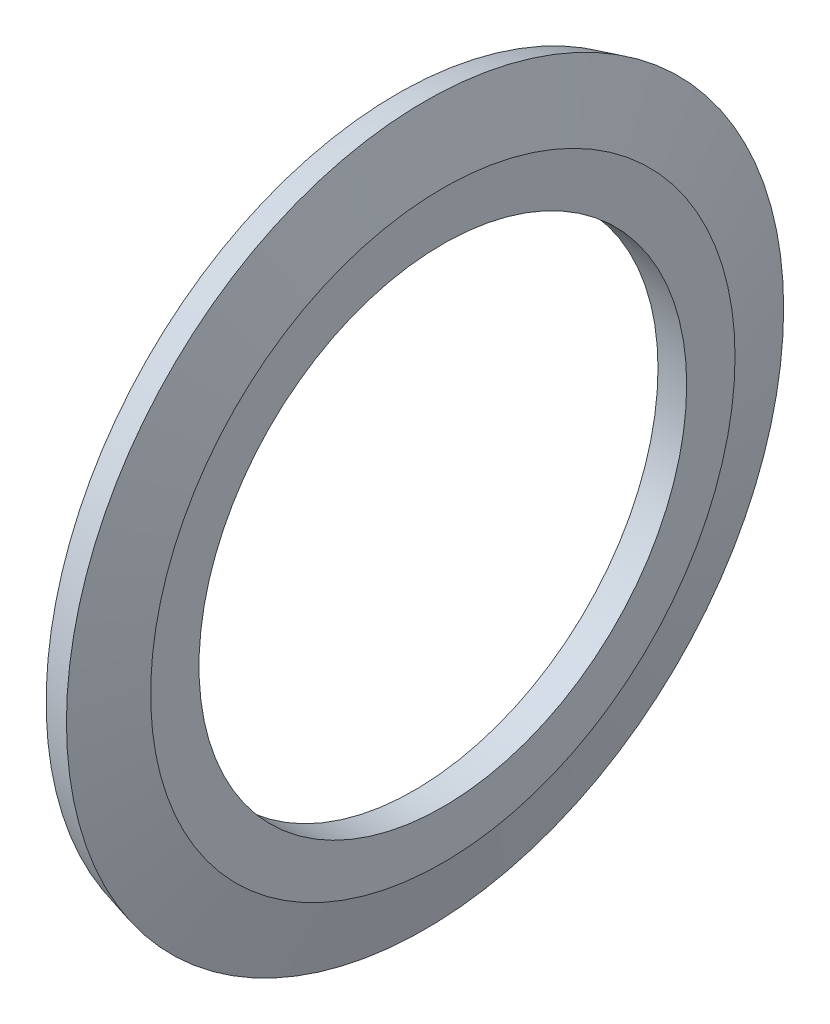
ISO-10303-21;
HEADER;
FILE_DESCRIPTION(('STEP AP214'),'2;1');
FILE_NAME('part.step','',(''),(''),'','','');
FILE_SCHEMA(('AUTOMOTIVE_DESIGN { 1 0 10303 214 1 1 1 1 }'));
ENDSEC;
DATA;
#1=APPLICATION_CONTEXT('core data for automotive mechanical design processes');
#2=APPLICATION_PROTOCOL_DEFINITION('international standard','automotive_design',2000,#1);
#3=PRODUCT_CONTEXT('',#1,'mechanical');
#4=PRODUCT('Part','Part','',(#3));
#5=PRODUCT_RELATED_PRODUCT_CATEGORY('part','',(#4));
#6=PRODUCT_DEFINITION_FORMATION('','',#4);
#7=PRODUCT_DEFINITION_CONTEXT('part definition',#1,'design');
#8=PRODUCT_DEFINITION('design','',#6,#7);
#9=PRODUCT_DEFINITION_SHAPE('','',#8);
#10=(LENGTH_UNIT() NAMED_UNIT(*) SI_UNIT(.MILLI.,.METRE.));
#11=(NAMED_UNIT(*) PLANE_ANGLE_UNIT() SI_UNIT($,.RADIAN.));
#12=(NAMED_UNIT(*) SI_UNIT($,.STERADIAN.) SOLID_ANGLE_UNIT());
#13=UNCERTAINTY_MEASURE_WITH_UNIT(LENGTH_MEASURE(1.E-05),#10,'distance_accuracy_value','');
#14=(GEOMETRIC_REPRESENTATION_CONTEXT(3) GLOBAL_UNCERTAINTY_ASSIGNED_CONTEXT((#13)) GLOBAL_UNIT_ASSIGNED_CONTEXT((#10,
#11,#12)) REPRESENTATION_CONTEXT('',''));
#15=CARTESIAN_POINT('',(0.,0.,0.));
#16=DIRECTION('',(0.,0.,1.));
#17=DIRECTION('',(1.,0.,0.));
#18=AXIS2_PLACEMENT_3D('',#15,#16,#17);
#19=CARTESIAN_POINT('',(0.999999999999999,8.5,0.));
#20=DIRECTION('',(1.,0.,0.));
#21=DIRECTION('',(0.,0.,-1.));
#22=AXIS2_PLACEMENT_3D('',#19,#20,#21);
#23=PLANE('',#22);
#24=CARTESIAN_POINT('',(0.999999999999999,0.,0.));
#25=DIRECTION('',(1.,0.,0.));
#26=DIRECTION('',(0.,0.,-1.));
#27=AXIS2_PLACEMENT_3D('',#24,#25,#26);
#28=CIRCLE('',#27,10.185);
#29=CARTESIAN_POINT('',(0.999999999999999,0.,-10.185));
#30=VERTEX_POINT('',#29);
#31=EDGE_CURVE('E10',#30,#30,#28,.T.);
#32=ORIENTED_EDGE('',*,*,#31,.T.);
#33=EDGE_LOOP('',(#32));
#34=FACE_BOUND('',#33,.T.);
#35=CARTESIAN_POINT('',(0.999999999999999,0.,0.));
#36=DIRECTION('',(1.,0.,0.));
#37=DIRECTION('',(0.,0.,-1.));
#38=AXIS2_PLACEMENT_3D('',#35,#36,#37);
#39=CIRCLE('',#38,8.5);
#40=CARTESIAN_POINT('',(0.999999999999999,0.,-8.5));
#41=VERTEX_POINT('',#40);
#42=EDGE_CURVE('E61',#41,#41,#39,.T.);
#43=ORIENTED_EDGE('',*,*,#42,.F.);
#44=EDGE_LOOP('',(#43));
#45=FACE_BOUND('',#44,.T.);
#46=ADVANCED_FACE('F33',(#34,#45),#23,.T.);
#47=CARTESIAN_POINT('',(0.999999999999999,0.,0.));
#48=DIRECTION('',(-1.,0.,0.));
#49=DIRECTION('',(0.,0.,1.));
#50=AXIS2_PLACEMENT_3D('',#47,#48,#49);
#51=CONICAL_SURFACE('',#50,10.185,1.30899693899575);
#52=CARTESIAN_POINT('',(0.379697619521947,0.,0.));
#53=DIRECTION('',(1.,0.,0.));
#54=DIRECTION('',(0.,0.,-1.));
#55=AXIS2_PLACEMENT_3D('',#52,#53,#54);
#56=CIRCLE('',#55,12.5);
#57=CARTESIAN_POINT('',(0.379697619521947,0.,-12.5));
#58=VERTEX_POINT('',#57);
#59=EDGE_CURVE('E40',#58,#58,#56,.T.);
#60=ORIENTED_EDGE('',*,*,#59,.T.);
#61=EDGE_LOOP('',(#60));
#62=FACE_BOUND('',#61,.T.);
#63=ORIENTED_EDGE('',*,*,#31,.F.);
#64=EDGE_LOOP('',(#63));
#65=FACE_BOUND('',#64,.T.);
#66=ADVANCED_FACE('F69',(#62,#65),#51,.T.);
#67=CARTESIAN_POINT('',(0.379697619521947,0.,0.));
#68=DIRECTION('',(1.,0.,0.));
#69=DIRECTION('',(0.,0.,-1.));
#70=AXIS2_PLACEMENT_3D('',#67,#68,#69);
#71=CONICAL_SURFACE('',#70,12.5,0.26179938779915);
#72=CARTESIAN_POINT('',(-0.586228206767122,0.,0.));
#73=DIRECTION('',(1.,0.,0.));
#74=DIRECTION('',(0.,0.,-1.));
#75=AXIS2_PLACEMENT_3D('',#72,#73,#74);
#76=CIRCLE('',#75,12.2411809548975);
#77=CARTESIAN_POINT('',(-0.586228206767122,0.,-12.2411809548975));
#78=VERTEX_POINT('',#77);
#79=EDGE_CURVE('E46',#78,#78,#76,.T.);
#80=ORIENTED_EDGE('',*,*,#79,.T.);
#81=EDGE_LOOP('',(#80));
#82=FACE_BOUND('',#81,.T.);
#83=ORIENTED_EDGE('',*,*,#59,.F.);
#84=EDGE_LOOP('',(#83));
#85=FACE_BOUND('',#84,.T.);
#86=ADVANCED_FACE('F73',(#82,#85),#71,.T.);
#87=CARTESIAN_POINT('',(-0.586228206767122,0.,0.));
#88=DIRECTION('',(-1.,0.,0.));
#89=DIRECTION('',(0.,0.,1.));
#90=AXIS2_PLACEMENT_3D('',#87,#88,#89);
#91=CONICAL_SURFACE('',#90,12.2411809548975,1.30899693899575);
#92=CARTESIAN_POINT('',(0.,0.,0.));
#93=DIRECTION('',(1.,0.,0.));
#94=DIRECTION('',(0.,0.,-1.));
#95=AXIS2_PLACEMENT_3D('',#92,#93,#94);
#96=CIRCLE('',#95,10.0533475024126);
#97=CARTESIAN_POINT('',(0.,0.,-10.0533475024126));
#98=VERTEX_POINT('',#97);
#99=EDGE_CURVE('E52',#98,#98,#96,.T.);
#100=ORIENTED_EDGE('',*,*,#99,.T.);
#101=EDGE_LOOP('',(#100));
#102=FACE_BOUND('',#101,.T.);
#103=ORIENTED_EDGE('',*,*,#79,.F.);
#104=EDGE_LOOP('',(#103));
#105=FACE_BOUND('',#104,.T.);
#106=ADVANCED_FACE('F77',(#102,#105),#91,.F.);
#107=CARTESIAN_POINT('',(0.,8.5,0.));
#108=DIRECTION('',(-1.,0.,0.));
#109=DIRECTION('',(0.,0.,1.));
#110=AXIS2_PLACEMENT_3D('',#107,#108,#109);
#111=PLANE('',#110);
#112=CARTESIAN_POINT('',(0.,0.,0.));
#113=DIRECTION('',(1.,0.,0.));
#114=DIRECTION('',(0.,0.,-1.));
#115=AXIS2_PLACEMENT_3D('',#112,#113,#114);
#116=CIRCLE('',#115,8.5);
#117=CARTESIAN_POINT('',(0.,0.,-8.5));
#118=VERTEX_POINT('',#117);
#119=EDGE_CURVE('E58',#118,#118,#116,.T.);
#120=ORIENTED_EDGE('',*,*,#119,.T.);
#121=EDGE_LOOP('',(#120));
#122=FACE_BOUND('',#121,.T.);
#123=ORIENTED_EDGE('',*,*,#99,.F.);
#124=EDGE_LOOP('',(#123));
#125=FACE_BOUND('',#124,.T.);
#126=ADVANCED_FACE('F84',(#122,#125),#111,.T.);
#127=CARTESIAN_POINT('',(0.999999999999999,0.,0.));
#128=DIRECTION('',(1.,0.,0.));
#129=DIRECTION('',(0.,0.,-1.));
#130=AXIS2_PLACEMENT_3D('',#127,#128,#129);
#131=CYLINDRICAL_SURFACE('',#130,8.5);
#132=ORIENTED_EDGE('',*,*,#42,.T.);
#133=EDGE_LOOP('',(#132));
#134=FACE_BOUND('',#133,.T.);
#135=ORIENTED_EDGE('',*,*,#119,.F.);
#136=EDGE_LOOP('',(#135));
#137=FACE_BOUND('',#136,.T.);
#138=ADVANCED_FACE('F65',(#134,#137),#131,.F.);
#139=CLOSED_SHELL('',(#46,#66,#86,#106,#126,#138));
#140=MANIFOLD_SOLID_BREP('B2',#139);
#141=ADVANCED_BREP_SHAPE_REPRESENTATION('',(#18,#140),#14);
#142=SHAPE_DEFINITION_REPRESENTATION(#9,#141);
ENDSEC;
END-ISO-10303-21;
